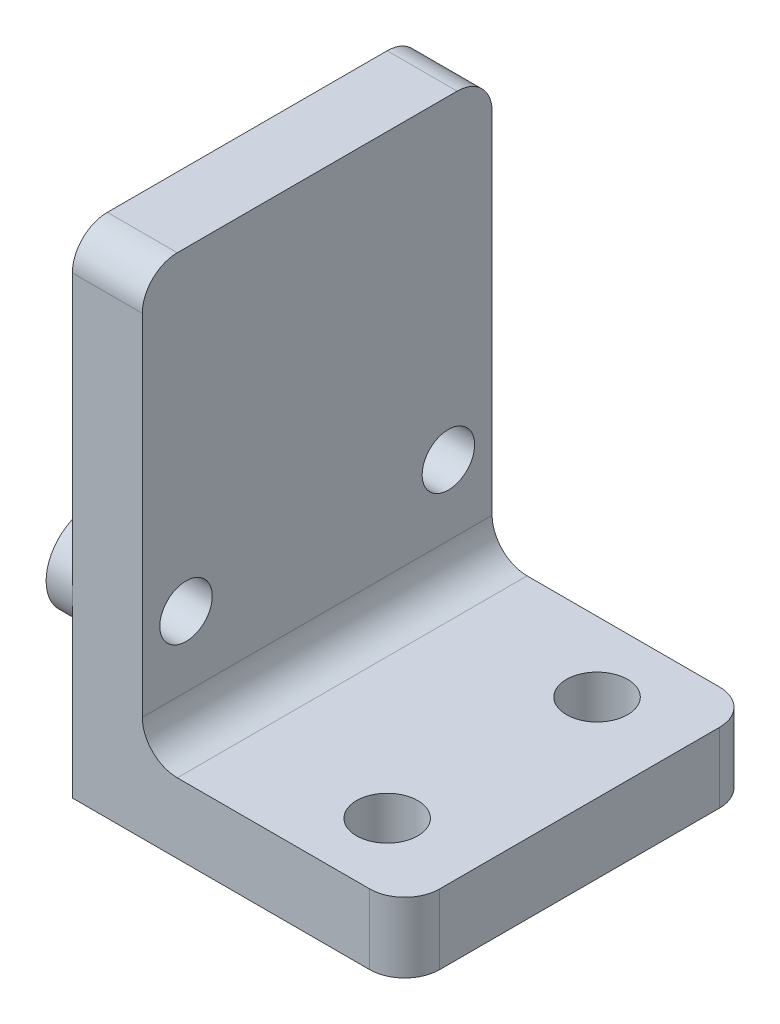
ISO-10303-21;
HEADER;
FILE_DESCRIPTION(('STEP AP214'),'2;1');
FILE_NAME('part.step','',(''),(''),'','','');
FILE_SCHEMA(('AUTOMOTIVE_DESIGN { 1 0 10303 214 1 1 1 1 }'));
ENDSEC;
DATA;
#1=APPLICATION_CONTEXT('core data for automotive mechanical design processes');
#2=APPLICATION_PROTOCOL_DEFINITION('international standard','automotive_design',2000,#1);
#3=PRODUCT_CONTEXT('',#1,'mechanical');
#4=PRODUCT('Part','Part','',(#3));
#5=PRODUCT_RELATED_PRODUCT_CATEGORY('part','',(#4));
#6=PRODUCT_DEFINITION_FORMATION('','',#4);
#7=PRODUCT_DEFINITION_CONTEXT('part definition',#1,'design');
#8=PRODUCT_DEFINITION('design','',#6,#7);
#9=PRODUCT_DEFINITION_SHAPE('','',#8);
#10=(LENGTH_UNIT() NAMED_UNIT(*) SI_UNIT(.MILLI.,.METRE.));
#11=(NAMED_UNIT(*) PLANE_ANGLE_UNIT() SI_UNIT($,.RADIAN.));
#12=(NAMED_UNIT(*) SI_UNIT($,.STERADIAN.) SOLID_ANGLE_UNIT());
#13=UNCERTAINTY_MEASURE_WITH_UNIT(LENGTH_MEASURE(1.E-05),#10,'distance_accuracy_value','');
#14=(GEOMETRIC_REPRESENTATION_CONTEXT(3) GLOBAL_UNCERTAINTY_ASSIGNED_CONTEXT((#13)) GLOBAL_UNIT_ASSIGNED_CONTEXT((#10,
#11,#12)) REPRESENTATION_CONTEXT('',''));
#15=CARTESIAN_POINT('',(0.,0.,0.));
#16=DIRECTION('',(0.,0.,1.));
#17=DIRECTION('',(1.,0.,0.));
#18=AXIS2_PLACEMENT_3D('',#15,#16,#17);
#19=CARTESIAN_POINT('',(0.,0.,20.));
#20=DIRECTION('',(1.,0.,0.));
#21=DIRECTION('',(0.,1.,0.));
#22=AXIS2_PLACEMENT_3D('',#19,#20,#21);
#23=PLANE('',#22);
#24=DIRECTION('',(0.,-1.,0.));
#25=VECTOR('',#24,1.);
#26=CARTESIAN_POINT('',(0.,0.,20.));
#27=LINE('',#26,#25);
#28=CARTESIAN_POINT('',(0.,10.,20.));
#29=VERTEX_POINT('',#28);
#30=CARTESIAN_POINT('',(0.,0.,20.));
#31=VERTEX_POINT('',#30);
#32=EDGE_CURVE('E141',#29,#31,#27,.T.);
#33=ORIENTED_EDGE('',*,*,#32,.F.);
#34=CARTESIAN_POINT('',(0.,10.,17.5));
#35=DIRECTION('',(-1.,0.,0.));
#36=DIRECTION('',(0.,-1.,0.));
#37=AXIS2_PLACEMENT_3D('',#34,#35,#36);
#38=CIRCLE('',#37,2.5);
#39=EDGE_CURVE('E151',#29,#29,#38,.T.);
#40=ORIENTED_EDGE('',*,*,#39,.F.);
#41=CARTESIAN_POINT('',(0.,26.,20.));
#42=VERTEX_POINT('',#41);
#43=EDGE_CURVE('E137',#42,#29,#27,.T.);
#44=ORIENTED_EDGE('',*,*,#43,.F.);
#45=CARTESIAN_POINT('',(0.,26.,18.));
#46=DIRECTION('',(1.,0.,0.));
#47=DIRECTION('',(0.,1.,0.));
#48=AXIS2_PLACEMENT_3D('',#45,#46,#47);
#49=CIRCLE('',#48,2.);
#50=CARTESIAN_POINT('',(0.,28.,18.));
#51=VERTEX_POINT('',#50);
#52=EDGE_CURVE('E71',#42,#51,#49,.F.);
#53=ORIENTED_EDGE('',*,*,#52,.T.);
#54=DIRECTION('',(0.,0.,-1.));
#55=VECTOR('',#54,1.);
#56=CARTESIAN_POINT('',(0.,28.,20.));
#57=LINE('',#56,#55);
#58=CARTESIAN_POINT('',(0.,28.,2.));
#59=VERTEX_POINT('',#58);
#60=EDGE_CURVE('E181',#51,#59,#57,.T.);
#61=ORIENTED_EDGE('',*,*,#60,.T.);
#62=CARTESIAN_POINT('',(0.,26.,2.));
#63=DIRECTION('',(1.,0.,0.));
#64=DIRECTION('',(0.,1.,0.));
#65=AXIS2_PLACEMENT_3D('',#62,#63,#64);
#66=CIRCLE('',#65,2.);
#67=CARTESIAN_POINT('',(0.,26.,0.));
#68=VERTEX_POINT('',#67);
#69=EDGE_CURVE('E63',#59,#68,#66,.F.);
#70=ORIENTED_EDGE('',*,*,#69,.T.);
#71=DIRECTION('',(0.,-1.,0.));
#72=VECTOR('',#71,1.);
#73=CARTESIAN_POINT('',(0.,0.,0.));
#74=LINE('',#73,#72);
#75=CARTESIAN_POINT('',(0.,10.,0.));
#76=VERTEX_POINT('',#75);
#77=EDGE_CURVE('E175',#68,#76,#74,.T.);
#78=ORIENTED_EDGE('',*,*,#77,.T.);
#79=CARTESIAN_POINT('',(0.,10.,2.5));
#80=DIRECTION('',(-1.,0.,0.));
#81=DIRECTION('',(0.,-1.,0.));
#82=AXIS2_PLACEMENT_3D('',#79,#80,#81);
#83=CIRCLE('',#82,2.5);
#84=EDGE_CURVE('E353',#76,#76,#83,.T.);
#85=ORIENTED_EDGE('',*,*,#84,.F.);
#86=CARTESIAN_POINT('',(0.,0.,0.));
#87=VERTEX_POINT('',#86);
#88=EDGE_CURVE('E174',#76,#87,#74,.T.);
#89=ORIENTED_EDGE('',*,*,#88,.T.);
#90=DIRECTION('',(0.,0.,-1.));
#91=VECTOR('',#90,1.);
#92=CARTESIAN_POINT('',(0.,0.,20.));
#93=LINE('',#92,#91);
#94=EDGE_CURVE('E148',#31,#87,#93,.T.);
#95=ORIENTED_EDGE('',*,*,#94,.F.);
#96=EDGE_LOOP('',(#33,#40,#44,#53,#61,#70,#78,#85,#89,#95));
#97=FACE_BOUND('',#96,.T.);
#98=ADVANCED_FACE('F47',(#97),#23,.F.);
#99=CARTESIAN_POINT('',(19.,0.,20.));
#100=DIRECTION('',(0.,1.,0.));
#101=DIRECTION('',(-1.,0.,0.));
#102=AXIS2_PLACEMENT_3D('',#99,#100,#101);
#103=PLANE('',#102);
#104=CARTESIAN_POINT('',(14.,0.,4.));
#105=DIRECTION('',(0.,1.,0.));
#106=DIRECTION('',(-1.,0.,0.));
#107=AXIS2_PLACEMENT_3D('',#104,#105,#106);
#108=CIRCLE('',#107,1.75);
#109=CARTESIAN_POINT('',(12.25,0.,4.));
#110=VERTEX_POINT('',#109);
#111=EDGE_CURVE('E336',#110,#110,#108,.T.);
#112=ORIENTED_EDGE('',*,*,#111,.T.);
#113=EDGE_LOOP('',(#112));
#114=FACE_BOUND('',#113,.T.);
#115=CARTESIAN_POINT('',(14.,0.,16.));
#116=DIRECTION('',(0.,1.,0.));
#117=DIRECTION('',(-1.,0.,0.));
#118=AXIS2_PLACEMENT_3D('',#115,#116,#117);
#119=CIRCLE('',#118,1.75);
#120=CARTESIAN_POINT('',(12.25,0.,16.));
#121=VERTEX_POINT('',#120);
#122=EDGE_CURVE('E337',#121,#121,#119,.T.);
#123=ORIENTED_EDGE('',*,*,#122,.T.);
#124=EDGE_LOOP('',(#123));
#125=FACE_BOUND('',#124,.T.);
#126=DIRECTION('',(1.,0.,0.));
#127=VECTOR('',#126,1.);
#128=CARTESIAN_POINT('',(19.,0.,0.));
#129=LINE('',#128,#127);
#130=CARTESIAN_POINT('',(17.,0.,0.));
#131=VERTEX_POINT('',#130);
#132=EDGE_CURVE('E161',#87,#131,#129,.T.);
#133=ORIENTED_EDGE('',*,*,#132,.T.);
#134=CARTESIAN_POINT('',(17.,0.,2.));
#135=DIRECTION('',(0.,1.,0.));
#136=DIRECTION('',(-1.,0.,0.));
#137=AXIS2_PLACEMENT_3D('',#134,#135,#136);
#138=CIRCLE('',#137,2.);
#139=CARTESIAN_POINT('',(19.,0.,2.));
#140=VERTEX_POINT('',#139);
#141=EDGE_CURVE('E221',#131,#140,#138,.F.);
#142=ORIENTED_EDGE('',*,*,#141,.T.);
#143=DIRECTION('',(0.,0.,-1.));
#144=VECTOR('',#143,1.);
#145=CARTESIAN_POINT('',(19.,0.,20.));
#146=LINE('',#145,#144);
#147=CARTESIAN_POINT('',(19.,0.,18.));
#148=VERTEX_POINT('',#147);
#149=EDGE_CURVE('E192',#148,#140,#146,.T.);
#150=ORIENTED_EDGE('',*,*,#149,.F.);
#151=CARTESIAN_POINT('',(17.,0.,18.));
#152=DIRECTION('',(0.,1.,0.));
#153=DIRECTION('',(-1.,0.,0.));
#154=AXIS2_PLACEMENT_3D('',#151,#152,#153);
#155=CIRCLE('',#154,2.);
#156=CARTESIAN_POINT('',(17.,0.,20.));
#157=VERTEX_POINT('',#156);
#158=EDGE_CURVE('E218',#148,#157,#155,.F.);
#159=ORIENTED_EDGE('',*,*,#158,.T.);
#160=DIRECTION('',(1.,0.,0.));
#161=VECTOR('',#160,1.);
#162=CARTESIAN_POINT('',(19.,0.,20.));
#163=LINE('',#162,#161);
#164=EDGE_CURVE('E178',#31,#157,#163,.T.);
#165=ORIENTED_EDGE('',*,*,#164,.F.);
#166=ORIENTED_EDGE('',*,*,#94,.T.);
#167=EDGE_LOOP('',(#133,#142,#150,#159,#165,#166));
#168=FACE_BOUND('',#167,.T.);
#169=ADVANCED_FACE('F288',(#114,#125,#168),#103,.F.);
#170=CARTESIAN_POINT('',(19.,4.,20.));
#171=DIRECTION('',(-1.,0.,0.));
#172=DIRECTION('',(0.,0.,1.));
#173=AXIS2_PLACEMENT_3D('',#170,#171,#172);
#174=PLANE('',#173);
#175=ORIENTED_EDGE('',*,*,#149,.T.);
#176=DIRECTION('',(0.,1.,0.));
#177=VECTOR('',#176,1.);
#178=CARTESIAN_POINT('',(19.,4.,2.));
#179=LINE('',#178,#177);
#180=CARTESIAN_POINT('',(19.,4.,2.));
#181=VERTEX_POINT('',#180);
#182=EDGE_CURVE('E199',#140,#181,#179,.T.);
#183=ORIENTED_EDGE('',*,*,#182,.T.);
#184=DIRECTION('',(0.,0.,-1.));
#185=VECTOR('',#184,1.);
#186=CARTESIAN_POINT('',(19.,4.,20.));
#187=LINE('',#186,#185);
#188=CARTESIAN_POINT('',(19.,4.,18.));
#189=VERTEX_POINT('',#188);
#190=EDGE_CURVE('E188',#189,#181,#187,.T.);
#191=ORIENTED_EDGE('',*,*,#190,.F.);
#192=DIRECTION('',(0.,1.,0.));
#193=VECTOR('',#192,1.);
#194=CARTESIAN_POINT('',(19.,4.,18.));
#195=LINE('',#194,#193);
#196=EDGE_CURVE('E196',#189,#148,#195,.F.);
#197=ORIENTED_EDGE('',*,*,#196,.T.);
#198=EDGE_LOOP('',(#175,#183,#191,#197));
#199=FACE_BOUND('',#198,.T.);
#200=ADVANCED_FACE('F294',(#199),#174,.F.);
#201=CARTESIAN_POINT('',(4.,4.,20.));
#202=DIRECTION('',(0.,-1.,0.));
#203=DIRECTION('',(1.,0.,0.));
#204=AXIS2_PLACEMENT_3D('',#201,#202,#203);
#205=PLANE('',#204);
#206=CARTESIAN_POINT('',(14.,4.,4.));
#207=DIRECTION('',(0.,1.,0.));
#208=DIRECTION('',(-1.,0.,0.));
#209=AXIS2_PLACEMENT_3D('',#206,#207,#208);
#210=CIRCLE('',#209,1.75);
#211=CARTESIAN_POINT('',(12.25,4.,4.));
#212=VERTEX_POINT('',#211);
#213=EDGE_CURVE('E346',#212,#212,#210,.T.);
#214=ORIENTED_EDGE('',*,*,#213,.F.);
#215=EDGE_LOOP('',(#214));
#216=FACE_BOUND('',#215,.T.);
#217=CARTESIAN_POINT('',(14.,4.,16.));
#218=DIRECTION('',(0.,1.,0.));
#219=DIRECTION('',(-1.,0.,0.));
#220=AXIS2_PLACEMENT_3D('',#217,#218,#219);
#221=CIRCLE('',#220,1.75);
#222=CARTESIAN_POINT('',(12.25,4.,16.));
#223=VERTEX_POINT('',#222);
#224=EDGE_CURVE('E341',#223,#223,#221,.T.);
#225=ORIENTED_EDGE('',*,*,#224,.F.);
#226=EDGE_LOOP('',(#225));
#227=FACE_BOUND('',#226,.T.);
#228=ORIENTED_EDGE('',*,*,#190,.T.);
#229=CARTESIAN_POINT('',(17.,4.,2.));
#230=DIRECTION('',(0.,-1.,0.));
#231=DIRECTION('',(1.,0.,0.));
#232=AXIS2_PLACEMENT_3D('',#229,#230,#231);
#233=CIRCLE('',#232,2.);
#234=CARTESIAN_POINT('',(17.,4.,0.));
#235=VERTEX_POINT('',#234);
#236=EDGE_CURVE('E209',#181,#235,#233,.F.);
#237=ORIENTED_EDGE('',*,*,#236,.T.);
#238=DIRECTION('',(-1.,0.,0.));
#239=VECTOR('',#238,1.);
#240=CARTESIAN_POINT('',(4.,4.,0.));
#241=LINE('',#240,#239);
#242=CARTESIAN_POINT('',(6.,4.,0.));
#243=VERTEX_POINT('',#242);
#244=EDGE_CURVE('E165',#235,#243,#241,.T.);
#245=ORIENTED_EDGE('',*,*,#244,.T.);
#246=DIRECTION('',(0.,0.,-1.));
#247=VECTOR('',#246,1.);
#248=CARTESIAN_POINT('',(6.,4.,20.));
#249=LINE('',#248,#247);
#250=CARTESIAN_POINT('',(6.,4.,20.));
#251=VERTEX_POINT('',#250);
#252=EDGE_CURVE('E203',#243,#251,#249,.F.);
#253=ORIENTED_EDGE('',*,*,#252,.T.);
#254=DIRECTION('',(-1.,0.,0.));
#255=VECTOR('',#254,1.);
#256=CARTESIAN_POINT('',(4.,4.,20.));
#257=LINE('',#256,#255);
#258=CARTESIAN_POINT('',(17.,4.,20.));
#259=VERTEX_POINT('',#258);
#260=EDGE_CURVE('E157',#259,#251,#257,.T.);
#261=ORIENTED_EDGE('',*,*,#260,.F.);
#262=CARTESIAN_POINT('',(17.,4.,18.));
#263=DIRECTION('',(0.,-1.,0.));
#264=DIRECTION('',(1.,0.,0.));
#265=AXIS2_PLACEMENT_3D('',#262,#263,#264);
#266=CIRCLE('',#265,2.);
#267=EDGE_CURVE('E206',#259,#189,#266,.F.);
#268=ORIENTED_EDGE('',*,*,#267,.T.);
#269=EDGE_LOOP('',(#228,#237,#245,#253,#261,#268));
#270=FACE_BOUND('',#269,.T.);
#271=ADVANCED_FACE('F259',(#216,#227,#270),#205,.F.);
#272=CARTESIAN_POINT('',(3.99999999999999,28.,20.));
#273=DIRECTION('',(-1.,0.,0.));
#274=DIRECTION('',(0.,-1.,0.));
#275=AXIS2_PLACEMENT_3D('',#272,#273,#274);
#276=PLANE('',#275);
#277=CARTESIAN_POINT('',(4.,10.,17.5));
#278=DIRECTION('',(-1.,0.,0.));
#279=DIRECTION('',(0.,-1.,0.));
#280=AXIS2_PLACEMENT_3D('',#277,#278,#279);
#281=CIRCLE('',#280,1.5);
#282=CARTESIAN_POINT('',(4.,8.5,17.5));
#283=VERTEX_POINT('',#282);
#284=EDGE_CURVE('E166',#283,#283,#281,.T.);
#285=ORIENTED_EDGE('',*,*,#284,.T.);
#286=EDGE_LOOP('',(#285));
#287=FACE_BOUND('',#286,.T.);
#288=CARTESIAN_POINT('',(4.,10.,2.5));
#289=DIRECTION('',(-1.,0.,0.));
#290=DIRECTION('',(0.,-1.,0.));
#291=AXIS2_PLACEMENT_3D('',#288,#289,#290);
#292=CIRCLE('',#291,1.5);
#293=CARTESIAN_POINT('',(4.,8.5,2.5));
#294=VERTEX_POINT('',#293);
#295=EDGE_CURVE('E332',#294,#294,#292,.T.);
#296=ORIENTED_EDGE('',*,*,#295,.T.);
#297=EDGE_LOOP('',(#296));
#298=FACE_BOUND('',#297,.T.);
#299=DIRECTION('',(0.,1.,0.));
#300=VECTOR('',#299,1.);
#301=CARTESIAN_POINT('',(3.99999999999999,28.,20.));
#302=LINE('',#301,#300);
#303=CARTESIAN_POINT('',(4.,6.00000000000001,20.));
#304=VERTEX_POINT('',#303);
#305=CARTESIAN_POINT('',(4.,26.,20.));
#306=VERTEX_POINT('',#305);
#307=EDGE_CURVE('E155',#304,#306,#302,.T.);
#308=ORIENTED_EDGE('',*,*,#307,.F.);
#309=DIRECTION('',(0.,0.,-1.));
#310=VECTOR('',#309,1.);
#311=CARTESIAN_POINT('',(4.,6.,0.));
#312=LINE('',#311,#310);
#313=CARTESIAN_POINT('',(4.,6.00000000000001,0.));
#314=VERTEX_POINT('',#313);
#315=EDGE_CURVE('E236',#304,#314,#312,.T.);
#316=ORIENTED_EDGE('',*,*,#315,.T.);
#317=DIRECTION('',(0.,1.,0.));
#318=VECTOR('',#317,1.);
#319=CARTESIAN_POINT('',(3.99999999999999,28.,0.));
#320=LINE('',#319,#318);
#321=CARTESIAN_POINT('',(4.,26.,0.));
#322=VERTEX_POINT('',#321);
#323=EDGE_CURVE('E170',#314,#322,#320,.T.);
#324=ORIENTED_EDGE('',*,*,#323,.T.);
#325=CARTESIAN_POINT('',(4.,26.,2.));
#326=DIRECTION('',(-1.,0.,0.));
#327=DIRECTION('',(0.,-1.,0.));
#328=AXIS2_PLACEMENT_3D('',#325,#326,#327);
#329=CIRCLE('',#328,2.);
#330=CARTESIAN_POINT('',(3.99999999999999,28.,2.));
#331=VERTEX_POINT('',#330);
#332=EDGE_CURVE('E233',#322,#331,#329,.F.);
#333=ORIENTED_EDGE('',*,*,#332,.T.);
#334=DIRECTION('',(0.,0.,-1.));
#335=VECTOR('',#334,1.);
#336=CARTESIAN_POINT('',(3.99999999999999,28.,20.));
#337=LINE('',#336,#335);
#338=CARTESIAN_POINT('',(3.99999999999999,28.,18.));
#339=VERTEX_POINT('',#338);
#340=EDGE_CURVE('E184',#339,#331,#337,.T.);
#341=ORIENTED_EDGE('',*,*,#340,.F.);
#342=CARTESIAN_POINT('',(4.,26.,18.));
#343=DIRECTION('',(-1.,0.,0.));
#344=DIRECTION('',(0.,-1.,0.));
#345=AXIS2_PLACEMENT_3D('',#342,#343,#344);
#346=CIRCLE('',#345,2.);
#347=EDGE_CURVE('E230',#339,#306,#346,.F.);
#348=ORIENTED_EDGE('',*,*,#347,.T.);
#349=EDGE_LOOP('',(#308,#316,#324,#333,#341,#348));
#350=FACE_BOUND('',#349,.T.);
#351=ADVANCED_FACE('F266',(#287,#298,#350),#276,.F.);
#352=CARTESIAN_POINT('',(0.,28.,20.));
#353=DIRECTION('',(0.,-1.,0.));
#354=DIRECTION('',(0.,0.,-1.));
#355=AXIS2_PLACEMENT_3D('',#352,#353,#354);
#356=PLANE('',#355);
#357=ORIENTED_EDGE('',*,*,#340,.T.);
#358=DIRECTION('',(-1.,0.,0.));
#359=VECTOR('',#358,1.);
#360=CARTESIAN_POINT('',(0.,28.,2.));
#361=LINE('',#360,#359);
#362=EDGE_CURVE('E243',#331,#59,#361,.T.);
#363=ORIENTED_EDGE('',*,*,#362,.T.);
#364=ORIENTED_EDGE('',*,*,#60,.F.);
#365=DIRECTION('',(-1.,0.,0.));
#366=VECTOR('',#365,1.);
#367=CARTESIAN_POINT('',(0.,28.,18.));
#368=LINE('',#367,#366);
#369=EDGE_CURVE('E240',#51,#339,#368,.F.);
#370=ORIENTED_EDGE('',*,*,#369,.T.);
#371=EDGE_LOOP('',(#357,#363,#364,#370));
#372=FACE_BOUND('',#371,.T.);
#373=ADVANCED_FACE('F272',(#372),#356,.F.);
#374=CARTESIAN_POINT('',(0.,0.,20.));
#375=DIRECTION('',(0.,0.,-1.));
#376=DIRECTION('',(-1.,0.,0.));
#377=AXIS2_PLACEMENT_3D('',#374,#375,#376);
#378=PLANE('',#377);
#379=ORIENTED_EDGE('',*,*,#164,.T.);
#380=DIRECTION('',(0.,1.,0.));
#381=VECTOR('',#380,1.);
#382=CARTESIAN_POINT('',(17.,0.,20.));
#383=LINE('',#382,#381);
#384=EDGE_CURVE('E226',#157,#259,#383,.T.);
#385=ORIENTED_EDGE('',*,*,#384,.T.);
#386=ORIENTED_EDGE('',*,*,#260,.T.);
#387=CARTESIAN_POINT('',(6.,6.,20.));
#388=DIRECTION('',(0.,0.,-1.));
#389=DIRECTION('',(-1.,0.,0.));
#390=AXIS2_PLACEMENT_3D('',#387,#388,#389);
#391=CIRCLE('',#390,2.);
#392=EDGE_CURVE('E11',#251,#304,#391,.T.);
#393=ORIENTED_EDGE('',*,*,#392,.T.);
#394=ORIENTED_EDGE('',*,*,#307,.T.);
#395=DIRECTION('',(-1.,0.,0.));
#396=VECTOR('',#395,1.);
#397=CARTESIAN_POINT('',(0.,26.,20.));
#398=LINE('',#397,#396);
#399=EDGE_CURVE('E145',#306,#42,#398,.T.);
#400=ORIENTED_EDGE('',*,*,#399,.T.);
#401=ORIENTED_EDGE('',*,*,#43,.T.);
#402=ORIENTED_EDGE('',*,*,#32,.T.);
#403=EDGE_LOOP('',(#379,#385,#386,#393,#394,#400,#401,#402));
#404=FACE_BOUND('',#403,.T.);
#405=ADVANCED_FACE('F140',(#404),#378,.F.);
#406=CARTESIAN_POINT('',(0.,0.,0.));
#407=DIRECTION('',(0.,0.,-1.));
#408=DIRECTION('',(-1.,0.,0.));
#409=AXIS2_PLACEMENT_3D('',#406,#407,#408);
#410=PLANE('',#409);
#411=ORIENTED_EDGE('',*,*,#244,.F.);
#412=DIRECTION('',(0.,1.,0.));
#413=VECTOR('',#412,1.);
#414=CARTESIAN_POINT('',(17.,0.,0.));
#415=LINE('',#414,#413);
#416=EDGE_CURVE('E215',#235,#131,#415,.F.);
#417=ORIENTED_EDGE('',*,*,#416,.T.);
#418=ORIENTED_EDGE('',*,*,#132,.F.);
#419=ORIENTED_EDGE('',*,*,#88,.F.);
#420=ORIENTED_EDGE('',*,*,#77,.F.);
#421=DIRECTION('',(-1.,0.,0.));
#422=VECTOR('',#421,1.);
#423=CARTESIAN_POINT('',(3.99999999999999,26.,0.));
#424=LINE('',#423,#422);
#425=EDGE_CURVE('E212',#68,#322,#424,.F.);
#426=ORIENTED_EDGE('',*,*,#425,.T.);
#427=ORIENTED_EDGE('',*,*,#323,.F.);
#428=CARTESIAN_POINT('',(6.,6.,0.));
#429=DIRECTION('',(0.,0.,-1.));
#430=DIRECTION('',(-1.,0.,0.));
#431=AXIS2_PLACEMENT_3D('',#428,#429,#430);
#432=CIRCLE('',#431,2.);
#433=EDGE_CURVE('E56',#314,#243,#432,.F.);
#434=ORIENTED_EDGE('',*,*,#433,.T.);
#435=EDGE_LOOP('',(#411,#417,#418,#419,#420,#426,#427,#434));
#436=FACE_BOUND('',#435,.T.);
#437=ADVANCED_FACE('F253',(#436),#410,.T.);
#438=CARTESIAN_POINT('',(19.,10.,2.5));
#439=DIRECTION('',(-1.,0.,0.));
#440=DIRECTION('',(0.,-1.,0.));
#441=AXIS2_PLACEMENT_3D('',#438,#439,#440);
#442=CYLINDRICAL_SURFACE('',#441,1.5);
#443=ORIENTED_EDGE('',*,*,#295,.F.);
#444=EDGE_LOOP('',(#443));
#445=FACE_BOUND('',#444,.T.);
#446=CARTESIAN_POINT('',(-1.5,10.,2.5));
#447=DIRECTION('',(-1.,0.,0.));
#448=DIRECTION('',(0.,-1.,0.));
#449=AXIS2_PLACEMENT_3D('',#446,#447,#448);
#450=CIRCLE('',#449,1.5);
#451=CARTESIAN_POINT('',(-1.5,8.5,2.5));
#452=VERTEX_POINT('',#451);
#453=EDGE_CURVE('E357',#452,#452,#450,.T.);
#454=ORIENTED_EDGE('',*,*,#453,.T.);
#455=EDGE_LOOP('',(#454));
#456=FACE_BOUND('',#455,.T.);
#457=ADVANCED_FACE('F403',(#445,#456),#442,.F.);
#458=CARTESIAN_POINT('',(19.,10.,17.5));
#459=DIRECTION('',(-1.,0.,0.));
#460=DIRECTION('',(0.,-1.,0.));
#461=AXIS2_PLACEMENT_3D('',#458,#459,#460);
#462=CYLINDRICAL_SURFACE('',#461,1.5);
#463=ORIENTED_EDGE('',*,*,#284,.F.);
#464=EDGE_LOOP('',(#463));
#465=FACE_BOUND('',#464,.T.);
#466=CARTESIAN_POINT('',(-1.5,10.,17.5));
#467=DIRECTION('',(-1.,0.,0.));
#468=DIRECTION('',(0.,-1.,0.));
#469=AXIS2_PLACEMENT_3D('',#466,#467,#468);
#470=CIRCLE('',#469,1.5);
#471=CARTESIAN_POINT('',(-1.5,8.5,17.5));
#472=VERTEX_POINT('',#471);
#473=EDGE_CURVE('E364',#472,#472,#470,.T.);
#474=ORIENTED_EDGE('',*,*,#473,.T.);
#475=EDGE_LOOP('',(#474));
#476=FACE_BOUND('',#475,.T.);
#477=ADVANCED_FACE('F399',(#465,#476),#462,.F.);
#478=CARTESIAN_POINT('',(14.,0.,16.));
#479=DIRECTION('',(0.,1.,0.));
#480=DIRECTION('',(-1.,0.,0.));
#481=AXIS2_PLACEMENT_3D('',#478,#479,#480);
#482=CYLINDRICAL_SURFACE('',#481,1.75);
#483=ORIENTED_EDGE('',*,*,#122,.F.);
#484=EDGE_LOOP('',(#483));
#485=FACE_BOUND('',#484,.T.);
#486=ORIENTED_EDGE('',*,*,#224,.T.);
#487=EDGE_LOOP('',(#486));
#488=FACE_BOUND('',#487,.T.);
#489=ADVANCED_FACE('F395',(#485,#488),#482,.F.);
#490=CARTESIAN_POINT('',(14.,0.,4.));
#491=DIRECTION('',(0.,1.,0.));
#492=DIRECTION('',(-1.,0.,0.));
#493=AXIS2_PLACEMENT_3D('',#490,#491,#492);
#494=CYLINDRICAL_SURFACE('',#493,1.75);
#495=ORIENTED_EDGE('',*,*,#111,.F.);
#496=EDGE_LOOP('',(#495));
#497=FACE_BOUND('',#496,.T.);
#498=ORIENTED_EDGE('',*,*,#213,.T.);
#499=EDGE_LOOP('',(#498));
#500=FACE_BOUND('',#499,.T.);
#501=ADVANCED_FACE('F314',(#497,#500),#494,.F.);
#502=CARTESIAN_POINT('',(17.,4.,2.));
#503=DIRECTION('',(0.,-1.,0.));
#504=DIRECTION('',(0.,0.,-1.));
#505=AXIS2_PLACEMENT_3D('',#502,#503,#504);
#506=CYLINDRICAL_SURFACE('',#505,2.);
#507=ORIENTED_EDGE('',*,*,#141,.F.);
#508=ORIENTED_EDGE('',*,*,#416,.F.);
#509=ORIENTED_EDGE('',*,*,#236,.F.);
#510=ORIENTED_EDGE('',*,*,#182,.F.);
#511=EDGE_LOOP('',(#507,#508,#509,#510));
#512=FACE_BOUND('',#511,.T.);
#513=ADVANCED_FACE('F311',(#512),#506,.T.);
#514=CARTESIAN_POINT('',(17.,0.,18.));
#515=DIRECTION('',(0.,1.,0.));
#516=DIRECTION('',(0.,0.,1.));
#517=AXIS2_PLACEMENT_3D('',#514,#515,#516);
#518=CYLINDRICAL_SURFACE('',#517,2.);
#519=ORIENTED_EDGE('',*,*,#158,.F.);
#520=ORIENTED_EDGE('',*,*,#196,.F.);
#521=ORIENTED_EDGE('',*,*,#267,.F.);
#522=ORIENTED_EDGE('',*,*,#384,.F.);
#523=EDGE_LOOP('',(#519,#520,#521,#522));
#524=FACE_BOUND('',#523,.T.);
#525=ADVANCED_FACE('F285',(#524),#518,.T.);
#526=CARTESIAN_POINT('',(6.,6.,20.));
#527=DIRECTION('',(0.,0.,1.));
#528=DIRECTION('',(1.,0.,0.));
#529=AXIS2_PLACEMENT_3D('',#526,#527,#528);
#530=CYLINDRICAL_SURFACE('',#529,2.);
#531=ORIENTED_EDGE('',*,*,#392,.F.);
#532=ORIENTED_EDGE('',*,*,#252,.F.);
#533=ORIENTED_EDGE('',*,*,#433,.F.);
#534=ORIENTED_EDGE('',*,*,#315,.F.);
#535=EDGE_LOOP('',(#531,#532,#533,#534));
#536=FACE_BOUND('',#535,.T.);
#537=ADVANCED_FACE('F263',(#536),#530,.F.);
#538=CARTESIAN_POINT('',(0.,26.,2.));
#539=DIRECTION('',(1.,0.,0.));
#540=DIRECTION('',(0.,0.,-1.));
#541=AXIS2_PLACEMENT_3D('',#538,#539,#540);
#542=CYLINDRICAL_SURFACE('',#541,2.);
#543=ORIENTED_EDGE('',*,*,#332,.F.);
#544=ORIENTED_EDGE('',*,*,#425,.F.);
#545=ORIENTED_EDGE('',*,*,#69,.F.);
#546=ORIENTED_EDGE('',*,*,#362,.F.);
#547=EDGE_LOOP('',(#543,#544,#545,#546));
#548=FACE_BOUND('',#547,.T.);
#549=ADVANCED_FACE('F278',(#548),#542,.T.);
#550=CARTESIAN_POINT('',(0.,26.,18.));
#551=DIRECTION('',(-1.,0.,0.));
#552=DIRECTION('',(0.,0.,1.));
#553=AXIS2_PLACEMENT_3D('',#550,#551,#552);
#554=CYLINDRICAL_SURFACE('',#553,2.);
#555=ORIENTED_EDGE('',*,*,#347,.F.);
#556=ORIENTED_EDGE('',*,*,#369,.F.);
#557=ORIENTED_EDGE('',*,*,#52,.F.);
#558=ORIENTED_EDGE('',*,*,#399,.F.);
#559=EDGE_LOOP('',(#555,#556,#557,#558));
#560=FACE_BOUND('',#559,.T.);
#561=ADVANCED_FACE('F49',(#560),#554,.T.);
#562=CARTESIAN_POINT('',(-1.5,10.,2.5));
#563=DIRECTION('',(-1.,0.,0.));
#564=DIRECTION('',(0.,-1.,0.));
#565=AXIS2_PLACEMENT_3D('',#562,#563,#564);
#566=PLANE('',#565);
#567=CARTESIAN_POINT('',(-1.5,10.,2.5));
#568=DIRECTION('',(-1.,0.,0.));
#569=DIRECTION('',(0.,-1.,0.));
#570=AXIS2_PLACEMENT_3D('',#567,#568,#569);
#571=CIRCLE('',#570,2.5);
#572=CARTESIAN_POINT('',(-1.5,7.5,2.5));
#573=VERTEX_POINT('',#572);
#574=EDGE_CURVE('E342',#573,#573,#571,.T.);
#575=ORIENTED_EDGE('',*,*,#574,.T.);
#576=EDGE_LOOP('',(#575));
#577=FACE_BOUND('',#576,.T.);
#578=ORIENTED_EDGE('',*,*,#453,.F.);
#579=EDGE_LOOP('',(#578));
#580=FACE_BOUND('',#579,.T.);
#581=ADVANCED_FACE('F284',(#577,#580),#566,.T.);
#582=CARTESIAN_POINT('',(-1.5,10.,2.5));
#583=DIRECTION('',(1.,0.,0.));
#584=DIRECTION('',(0.,1.,0.));
#585=AXIS2_PLACEMENT_3D('',#582,#583,#584);
#586=CYLINDRICAL_SURFACE('',#585,2.5);
#587=ORIENTED_EDGE('',*,*,#574,.F.);
#588=EDGE_LOOP('',(#587));
#589=FACE_BOUND('',#588,.T.);
#590=ORIENTED_EDGE('',*,*,#84,.T.);
#591=EDGE_LOOP('',(#590));
#592=FACE_BOUND('',#591,.T.);
#593=ADVANCED_FACE('F382',(#589,#592),#586,.T.);
#594=CARTESIAN_POINT('',(-1.5,10.,17.5));
#595=DIRECTION('',(-1.,0.,0.));
#596=DIRECTION('',(0.,-1.,0.));
#597=AXIS2_PLACEMENT_3D('',#594,#595,#596);
#598=PLANE('',#597);
#599=CARTESIAN_POINT('',(-1.5,10.,17.5));
#600=DIRECTION('',(-1.,0.,0.));
#601=DIRECTION('',(0.,-1.,0.));
#602=AXIS2_PLACEMENT_3D('',#599,#600,#601);
#603=CIRCLE('',#602,2.5);
#604=CARTESIAN_POINT('',(-1.5,7.50000000000001,17.5));
#605=VERTEX_POINT('',#604);
#606=EDGE_CURVE('E368',#605,#605,#603,.T.);
#607=ORIENTED_EDGE('',*,*,#606,.T.);
#608=EDGE_LOOP('',(#607));
#609=FACE_BOUND('',#608,.T.);
#610=ORIENTED_EDGE('',*,*,#473,.F.);
#611=EDGE_LOOP('',(#610));
#612=FACE_BOUND('',#611,.T.);
#613=ADVANCED_FACE('F376',(#609,#612),#598,.T.);
#614=CARTESIAN_POINT('',(-1.5,10.,17.5));
#615=DIRECTION('',(1.,0.,0.));
#616=DIRECTION('',(0.,1.,0.));
#617=AXIS2_PLACEMENT_3D('',#614,#615,#616);
#618=CYLINDRICAL_SURFACE('',#617,2.5);
#619=ORIENTED_EDGE('',*,*,#606,.F.);
#620=EDGE_LOOP('',(#619));
#621=FACE_BOUND('',#620,.T.);
#622=ORIENTED_EDGE('',*,*,#39,.T.);
#623=EDGE_LOOP('',(#622));
#624=FACE_BOUND('',#623,.T.);
#625=ADVANCED_FACE('F374',(#621,#624),#618,.T.);
#626=CLOSED_SHELL('',(#98,#169,#200,#271,#351,#373,#405,#437,#457,#477,#489,#501,#513,#525,#537,
#549,#561,#581,#593,#613,#625));
#627=MANIFOLD_SOLID_BREP('B2',#626);
#628=ADVANCED_BREP_SHAPE_REPRESENTATION('',(#18,#627),#14);
#629=SHAPE_DEFINITION_REPRESENTATION(#9,#628);
ENDSEC;
END-ISO-10303-21;
